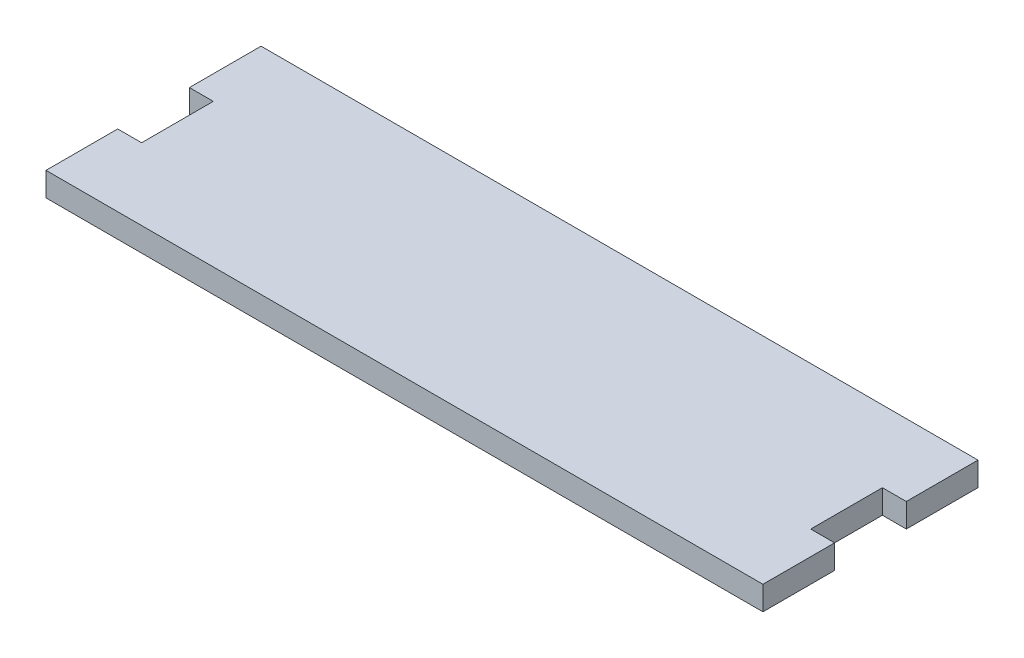
ISO-10303-21;
HEADER;
FILE_DESCRIPTION(('STEP AP214'),'2;1');
FILE_NAME('part.step','',(''),(''),'','','');
FILE_SCHEMA(('AUTOMOTIVE_DESIGN { 1 0 10303 214 1 1 1 1 }'));
ENDSEC;
DATA;
#1=APPLICATION_CONTEXT('core data for automotive mechanical design processes');
#2=APPLICATION_PROTOCOL_DEFINITION('international standard','automotive_design',2000,#1);
#3=PRODUCT_CONTEXT('',#1,'mechanical');
#4=PRODUCT('Part','Part','',(#3));
#5=PRODUCT_RELATED_PRODUCT_CATEGORY('part','',(#4));
#6=PRODUCT_DEFINITION_FORMATION('','',#4);
#7=PRODUCT_DEFINITION_CONTEXT('part definition',#1,'design');
#8=PRODUCT_DEFINITION('design','',#6,#7);
#9=PRODUCT_DEFINITION_SHAPE('','',#8);
#10=(LENGTH_UNIT() NAMED_UNIT(*) SI_UNIT(.MILLI.,.METRE.));
#11=(NAMED_UNIT(*) PLANE_ANGLE_UNIT() SI_UNIT($,.RADIAN.));
#12=(NAMED_UNIT(*) SI_UNIT($,.STERADIAN.) SOLID_ANGLE_UNIT());
#13=UNCERTAINTY_MEASURE_WITH_UNIT(LENGTH_MEASURE(1.E-05),#10,'distance_accuracy_value','');
#14=(GEOMETRIC_REPRESENTATION_CONTEXT(3) GLOBAL_UNCERTAINTY_ASSIGNED_CONTEXT((#13)) GLOBAL_UNIT_ASSIGNED_CONTEXT((#10,
#11,#12)) REPRESENTATION_CONTEXT('',''));
#15=CARTESIAN_POINT('',(0.,0.,0.));
#16=DIRECTION('',(0.,0.,1.));
#17=DIRECTION('',(1.,0.,0.));
#18=AXIS2_PLACEMENT_3D('',#15,#16,#17);
#19=CARTESIAN_POINT('',(70.,5.,0.));
#20=DIRECTION('',(1.,0.,0.));
#21=DIRECTION('',(0.,0.,-1.));
#22=AXIS2_PLACEMENT_3D('',#19,#20,#21);
#23=PLANE('',#22);
#24=DIRECTION('',(0.,0.,1.));
#25=VECTOR('',#24,1.);
#26=CARTESIAN_POINT('',(70.,0.,0.));
#27=LINE('',#26,#25);
#28=CARTESIAN_POINT('',(70.,0.,-7.5));
#29=VERTEX_POINT('',#28);
#30=CARTESIAN_POINT('',(70.,0.,7.5));
#31=VERTEX_POINT('',#30);
#32=EDGE_CURVE('E153',#29,#31,#27,.T.);
#33=ORIENTED_EDGE('',*,*,#32,.F.);
#34=DIRECTION('',(0.,-1.,0.));
#35=VECTOR('',#34,1.);
#36=CARTESIAN_POINT('',(70.,5.,-7.5));
#37=LINE('',#36,#35);
#38=CARTESIAN_POINT('',(70.,5.,-7.5));
#39=VERTEX_POINT('',#38);
#40=EDGE_CURVE('E11',#39,#29,#37,.T.);
#41=ORIENTED_EDGE('',*,*,#40,.F.);
#42=DIRECTION('',(0.,0.,1.));
#43=VECTOR('',#42,1.);
#44=CARTESIAN_POINT('',(70.,5.,0.));
#45=LINE('',#44,#43);
#46=CARTESIAN_POINT('',(70.,5.,7.5));
#47=VERTEX_POINT('',#46);
#48=EDGE_CURVE('E184',#39,#47,#45,.T.);
#49=ORIENTED_EDGE('',*,*,#48,.T.);
#50=DIRECTION('',(0.,-1.,0.));
#51=VECTOR('',#50,1.);
#52=CARTESIAN_POINT('',(70.,5.,7.5));
#53=LINE('',#52,#51);
#54=EDGE_CURVE('E52',#47,#31,#53,.T.);
#55=ORIENTED_EDGE('',*,*,#54,.T.);
#56=EDGE_LOOP('',(#33,#41,#49,#55));
#57=FACE_BOUND('',#56,.T.);
#58=ADVANCED_FACE('F36',(#57),#23,.T.);
#59=CARTESIAN_POINT('',(0.,5.,-7.5));
#60=DIRECTION('',(0.,0.,-1.));
#61=DIRECTION('',(-1.,0.,0.));
#62=AXIS2_PLACEMENT_3D('',#59,#60,#61);
#63=PLANE('',#62);
#64=DIRECTION('',(1.,0.,0.));
#65=VECTOR('',#64,1.);
#66=CARTESIAN_POINT('',(0.,0.,-7.5));
#67=LINE('',#66,#65);
#68=CARTESIAN_POINT('',(75.,0.,-7.5));
#69=VERTEX_POINT('',#68);
#70=EDGE_CURVE('E155',#29,#69,#67,.T.);
#71=ORIENTED_EDGE('',*,*,#70,.T.);
#72=DIRECTION('',(0.,-1.,0.));
#73=VECTOR('',#72,1.);
#74=CARTESIAN_POINT('',(75.,5.,-7.5));
#75=LINE('',#74,#73);
#76=CARTESIAN_POINT('',(75.,5.,-7.5));
#77=VERTEX_POINT('',#76);
#78=EDGE_CURVE('E44',#77,#69,#75,.T.);
#79=ORIENTED_EDGE('',*,*,#78,.F.);
#80=DIRECTION('',(1.,0.,0.));
#81=VECTOR('',#80,1.);
#82=CARTESIAN_POINT('',(0.,5.,-7.5));
#83=LINE('',#82,#81);
#84=EDGE_CURVE('E220',#39,#77,#83,.T.);
#85=ORIENTED_EDGE('',*,*,#84,.F.);
#86=ORIENTED_EDGE('',*,*,#40,.T.);
#87=EDGE_LOOP('',(#71,#79,#85,#86));
#88=FACE_BOUND('',#87,.T.);
#89=ADVANCED_FACE('F209',(#88),#63,.F.);
#90=CARTESIAN_POINT('',(75.,5.,0.));
#91=DIRECTION('',(1.,0.,0.));
#92=DIRECTION('',(0.,0.,-1.));
#93=AXIS2_PLACEMENT_3D('',#90,#91,#92);
#94=PLANE('',#93);
#95=DIRECTION('',(0.,0.,1.));
#96=VECTOR('',#95,1.);
#97=CARTESIAN_POINT('',(75.,0.,0.));
#98=LINE('',#97,#96);
#99=CARTESIAN_POINT('',(75.,0.,-22.5));
#100=VERTEX_POINT('',#99);
#101=EDGE_CURVE('E158',#100,#69,#98,.T.);
#102=ORIENTED_EDGE('',*,*,#101,.F.);
#103=DIRECTION('',(0.,-1.,0.));
#104=VECTOR('',#103,1.);
#105=CARTESIAN_POINT('',(75.,5.,-22.5));
#106=LINE('',#105,#104);
#107=CARTESIAN_POINT('',(75.,5.,-22.5));
#108=VERTEX_POINT('',#107);
#109=EDGE_CURVE('E199',#108,#100,#106,.T.);
#110=ORIENTED_EDGE('',*,*,#109,.F.);
#111=DIRECTION('',(0.,0.,1.));
#112=VECTOR('',#111,1.);
#113=CARTESIAN_POINT('',(75.,5.,0.));
#114=LINE('',#113,#112);
#115=EDGE_CURVE('E206',#108,#77,#114,.T.);
#116=ORIENTED_EDGE('',*,*,#115,.T.);
#117=ORIENTED_EDGE('',*,*,#78,.T.);
#118=EDGE_LOOP('',(#102,#110,#116,#117));
#119=FACE_BOUND('',#118,.T.);
#120=ADVANCED_FACE('F204',(#119),#94,.T.);
#121=CARTESIAN_POINT('',(0.,5.,-22.5));
#122=DIRECTION('',(0.,0.,-1.));
#123=DIRECTION('',(-1.,0.,0.));
#124=AXIS2_PLACEMENT_3D('',#121,#122,#123);
#125=PLANE('',#124);
#126=DIRECTION('',(1.,0.,0.));
#127=VECTOR('',#126,1.);
#128=CARTESIAN_POINT('',(0.,0.,-22.5));
#129=LINE('',#128,#127);
#130=CARTESIAN_POINT('',(-75.,0.,-22.5));
#131=VERTEX_POINT('',#130);
#132=EDGE_CURVE('E161',#131,#100,#129,.T.);
#133=ORIENTED_EDGE('',*,*,#132,.F.);
#134=DIRECTION('',(0.,-1.,0.));
#135=VECTOR('',#134,1.);
#136=CARTESIAN_POINT('',(-75.,5.,-22.5));
#137=LINE('',#136,#135);
#138=CARTESIAN_POINT('',(-75.,5.,-22.5));
#139=VERTEX_POINT('',#138);
#140=EDGE_CURVE('E197',#139,#131,#137,.T.);
#141=ORIENTED_EDGE('',*,*,#140,.F.);
#142=DIRECTION('',(1.,0.,0.));
#143=VECTOR('',#142,1.);
#144=CARTESIAN_POINT('',(0.,5.,-22.5));
#145=LINE('',#144,#143);
#146=EDGE_CURVE('E219',#139,#108,#145,.T.);
#147=ORIENTED_EDGE('',*,*,#146,.T.);
#148=ORIENTED_EDGE('',*,*,#109,.T.);
#149=EDGE_LOOP('',(#133,#141,#147,#148));
#150=FACE_BOUND('',#149,.T.);
#151=ADVANCED_FACE('F215',(#150),#125,.T.);
#152=CARTESIAN_POINT('',(-75.,5.,0.));
#153=DIRECTION('',(1.,0.,0.));
#154=DIRECTION('',(0.,0.,-1.));
#155=AXIS2_PLACEMENT_3D('',#152,#153,#154);
#156=PLANE('',#155);
#157=DIRECTION('',(0.,0.,1.));
#158=VECTOR('',#157,1.);
#159=CARTESIAN_POINT('',(-75.,0.,0.));
#160=LINE('',#159,#158);
#161=CARTESIAN_POINT('',(-75.,0.,-7.5));
#162=VERTEX_POINT('',#161);
#163=EDGE_CURVE('E164',#131,#162,#160,.T.);
#164=ORIENTED_EDGE('',*,*,#163,.T.);
#165=DIRECTION('',(0.,-1.,0.));
#166=VECTOR('',#165,1.);
#167=CARTESIAN_POINT('',(-75.,5.,-7.5));
#168=LINE('',#167,#166);
#169=CARTESIAN_POINT('',(-75.,5.,-7.5));
#170=VERTEX_POINT('',#169);
#171=EDGE_CURVE('E195',#170,#162,#168,.T.);
#172=ORIENTED_EDGE('',*,*,#171,.F.);
#173=DIRECTION('',(0.,0.,1.));
#174=VECTOR('',#173,1.);
#175=CARTESIAN_POINT('',(-75.,5.,0.));
#176=LINE('',#175,#174);
#177=EDGE_CURVE('E222',#139,#170,#176,.T.);
#178=ORIENTED_EDGE('',*,*,#177,.F.);
#179=ORIENTED_EDGE('',*,*,#140,.T.);
#180=EDGE_LOOP('',(#164,#172,#178,#179));
#181=FACE_BOUND('',#180,.T.);
#182=ADVANCED_FACE('F260',(#181),#156,.F.);
#183=CARTESIAN_POINT('',(0.,5.,-7.50000000000001));
#184=DIRECTION('',(0.,0.,1.));
#185=DIRECTION('',(1.,0.,0.));
#186=AXIS2_PLACEMENT_3D('',#183,#184,#185);
#187=PLANE('',#186);
#188=DIRECTION('',(-1.,0.,0.));
#189=VECTOR('',#188,1.);
#190=CARTESIAN_POINT('',(0.,0.,-7.50000000000001));
#191=LINE('',#190,#189);
#192=CARTESIAN_POINT('',(-70.,0.,-7.5));
#193=VERTEX_POINT('',#192);
#194=EDGE_CURVE('E167',#193,#162,#191,.T.);
#195=ORIENTED_EDGE('',*,*,#194,.F.);
#196=DIRECTION('',(0.,-1.,0.));
#197=VECTOR('',#196,1.);
#198=CARTESIAN_POINT('',(-70.,5.,-7.5));
#199=LINE('',#198,#197);
#200=CARTESIAN_POINT('',(-70.,5.,-7.5));
#201=VERTEX_POINT('',#200);
#202=EDGE_CURVE('E193',#201,#193,#199,.T.);
#203=ORIENTED_EDGE('',*,*,#202,.F.);
#204=DIRECTION('',(-1.,0.,0.));
#205=VECTOR('',#204,1.);
#206=CARTESIAN_POINT('',(0.,5.,-7.50000000000001));
#207=LINE('',#206,#205);
#208=EDGE_CURVE('E228',#201,#170,#207,.T.);
#209=ORIENTED_EDGE('',*,*,#208,.T.);
#210=ORIENTED_EDGE('',*,*,#171,.T.);
#211=EDGE_LOOP('',(#195,#203,#209,#210));
#212=FACE_BOUND('',#211,.T.);
#213=ADVANCED_FACE('F263',(#212),#187,.T.);
#214=CARTESIAN_POINT('',(-70.,5.,0.));
#215=DIRECTION('',(1.,0.,0.));
#216=DIRECTION('',(0.,0.,-1.));
#217=AXIS2_PLACEMENT_3D('',#214,#215,#216);
#218=PLANE('',#217);
#219=DIRECTION('',(0.,0.,1.));
#220=VECTOR('',#219,1.);
#221=CARTESIAN_POINT('',(-70.,0.,0.));
#222=LINE('',#221,#220);
#223=CARTESIAN_POINT('',(-70.,0.,7.5));
#224=VERTEX_POINT('',#223);
#225=EDGE_CURVE('E170',#193,#224,#222,.T.);
#226=ORIENTED_EDGE('',*,*,#225,.T.);
#227=DIRECTION('',(0.,-1.,0.));
#228=VECTOR('',#227,1.);
#229=CARTESIAN_POINT('',(-70.,5.,7.5));
#230=LINE('',#229,#228);
#231=CARTESIAN_POINT('',(-70.,5.,7.5));
#232=VERTEX_POINT('',#231);
#233=EDGE_CURVE('E190',#232,#224,#230,.T.);
#234=ORIENTED_EDGE('',*,*,#233,.F.);
#235=DIRECTION('',(0.,0.,1.));
#236=VECTOR('',#235,1.);
#237=CARTESIAN_POINT('',(-70.,5.,0.));
#238=LINE('',#237,#236);
#239=EDGE_CURVE('E231',#201,#232,#238,.T.);
#240=ORIENTED_EDGE('',*,*,#239,.F.);
#241=ORIENTED_EDGE('',*,*,#202,.T.);
#242=EDGE_LOOP('',(#226,#234,#240,#241));
#243=FACE_BOUND('',#242,.T.);
#244=ADVANCED_FACE('F267',(#243),#218,.F.);
#245=CARTESIAN_POINT('',(0.,5.,7.5));
#246=DIRECTION('',(0.,0.,1.));
#247=DIRECTION('',(1.,0.,0.));
#248=AXIS2_PLACEMENT_3D('',#245,#246,#247);
#249=PLANE('',#248);
#250=DIRECTION('',(-1.,0.,0.));
#251=VECTOR('',#250,1.);
#252=CARTESIAN_POINT('',(0.,0.,7.5));
#253=LINE('',#252,#251);
#254=CARTESIAN_POINT('',(-75.,0.,7.5));
#255=VERTEX_POINT('',#254);
#256=EDGE_CURVE('E172',#224,#255,#253,.T.);
#257=ORIENTED_EDGE('',*,*,#256,.T.);
#258=DIRECTION('',(0.,-1.,0.));
#259=VECTOR('',#258,1.);
#260=CARTESIAN_POINT('',(-75.,5.,7.5));
#261=LINE('',#260,#259);
#262=CARTESIAN_POINT('',(-75.,5.,7.5));
#263=VERTEX_POINT('',#262);
#264=EDGE_CURVE('E188',#263,#255,#261,.T.);
#265=ORIENTED_EDGE('',*,*,#264,.F.);
#266=DIRECTION('',(-1.,0.,0.));
#267=VECTOR('',#266,1.);
#268=CARTESIAN_POINT('',(0.,5.,7.5));
#269=LINE('',#268,#267);
#270=EDGE_CURVE('E233',#232,#263,#269,.T.);
#271=ORIENTED_EDGE('',*,*,#270,.F.);
#272=ORIENTED_EDGE('',*,*,#233,.T.);
#273=EDGE_LOOP('',(#257,#265,#271,#272));
#274=FACE_BOUND('',#273,.T.);
#275=ADVANCED_FACE('F271',(#274),#249,.F.);
#276=CARTESIAN_POINT('',(-75.,5.,0.));
#277=DIRECTION('',(-1.,0.,0.));
#278=DIRECTION('',(0.,0.,1.));
#279=AXIS2_PLACEMENT_3D('',#276,#277,#278);
#280=PLANE('',#279);
#281=DIRECTION('',(0.,0.,-1.));
#282=VECTOR('',#281,1.);
#283=CARTESIAN_POINT('',(-75.,0.,0.));
#284=LINE('',#283,#282);
#285=CARTESIAN_POINT('',(-75.,0.,22.5));
#286=VERTEX_POINT('',#285);
#287=EDGE_CURVE('E175',#286,#255,#284,.T.);
#288=ORIENTED_EDGE('',*,*,#287,.F.);
#289=DIRECTION('',(0.,-1.,0.));
#290=VECTOR('',#289,1.);
#291=CARTESIAN_POINT('',(-75.,5.,22.5));
#292=LINE('',#291,#290);
#293=CARTESIAN_POINT('',(-75.,5.,22.5));
#294=VERTEX_POINT('',#293);
#295=EDGE_CURVE('E145',#294,#286,#292,.T.);
#296=ORIENTED_EDGE('',*,*,#295,.F.);
#297=DIRECTION('',(0.,0.,-1.));
#298=VECTOR('',#297,1.);
#299=CARTESIAN_POINT('',(-75.,5.,0.));
#300=LINE('',#299,#298);
#301=EDGE_CURVE('E135',#294,#263,#300,.T.);
#302=ORIENTED_EDGE('',*,*,#301,.T.);
#303=ORIENTED_EDGE('',*,*,#264,.T.);
#304=EDGE_LOOP('',(#288,#296,#302,#303));
#305=FACE_BOUND('',#304,.T.);
#306=ADVANCED_FACE('F236',(#305),#280,.T.);
#307=CARTESIAN_POINT('',(0.,5.,22.5));
#308=DIRECTION('',(0.,0.,-1.));
#309=DIRECTION('',(-1.,0.,0.));
#310=AXIS2_PLACEMENT_3D('',#307,#308,#309);
#311=PLANE('',#310);
#312=DIRECTION('',(1.,0.,0.));
#313=VECTOR('',#312,1.);
#314=CARTESIAN_POINT('',(0.,0.,22.5));
#315=LINE('',#314,#313);
#316=CARTESIAN_POINT('',(75.,0.,22.5));
#317=VERTEX_POINT('',#316);
#318=EDGE_CURVE('E142',#286,#317,#315,.T.);
#319=ORIENTED_EDGE('',*,*,#318,.T.);
#320=DIRECTION('',(0.,-1.,0.));
#321=VECTOR('',#320,1.);
#322=CARTESIAN_POINT('',(75.,5.,22.5));
#323=LINE('',#322,#321);
#324=CARTESIAN_POINT('',(75.,5.,22.5));
#325=VERTEX_POINT('',#324);
#326=EDGE_CURVE('E139',#325,#317,#323,.T.);
#327=ORIENTED_EDGE('',*,*,#326,.F.);
#328=DIRECTION('',(1.,0.,0.));
#329=VECTOR('',#328,1.);
#330=CARTESIAN_POINT('',(0.,5.,22.5));
#331=LINE('',#330,#329);
#332=EDGE_CURVE('E127',#294,#325,#331,.T.);
#333=ORIENTED_EDGE('',*,*,#332,.F.);
#334=ORIENTED_EDGE('',*,*,#295,.T.);
#335=EDGE_LOOP('',(#319,#327,#333,#334));
#336=FACE_BOUND('',#335,.T.);
#337=ADVANCED_FACE('F140',(#336),#311,.F.);
#338=CARTESIAN_POINT('',(75.,5.,0.));
#339=DIRECTION('',(-1.,0.,0.));
#340=DIRECTION('',(0.,0.,1.));
#341=AXIS2_PLACEMENT_3D('',#338,#339,#340);
#342=PLANE('',#341);
#343=DIRECTION('',(0.,0.,-1.));
#344=VECTOR('',#343,1.);
#345=CARTESIAN_POINT('',(75.,0.,0.));
#346=LINE('',#345,#344);
#347=CARTESIAN_POINT('',(75.,0.,7.5));
#348=VERTEX_POINT('',#347);
#349=EDGE_CURVE('E179',#317,#348,#346,.T.);
#350=ORIENTED_EDGE('',*,*,#349,.T.);
#351=DIRECTION('',(0.,-1.,0.));
#352=VECTOR('',#351,1.);
#353=CARTESIAN_POINT('',(75.,5.,7.5));
#354=LINE('',#353,#352);
#355=CARTESIAN_POINT('',(75.,5.,7.5));
#356=VERTEX_POINT('',#355);
#357=EDGE_CURVE('E90',#356,#348,#354,.T.);
#358=ORIENTED_EDGE('',*,*,#357,.F.);
#359=DIRECTION('',(0.,0.,-1.));
#360=VECTOR('',#359,1.);
#361=CARTESIAN_POINT('',(75.,5.,0.));
#362=LINE('',#361,#360);
#363=EDGE_CURVE('E133',#325,#356,#362,.T.);
#364=ORIENTED_EDGE('',*,*,#363,.F.);
#365=ORIENTED_EDGE('',*,*,#326,.T.);
#366=EDGE_LOOP('',(#350,#358,#364,#365));
#367=FACE_BOUND('',#366,.T.);
#368=ADVANCED_FACE('F147',(#367),#342,.F.);
#369=CARTESIAN_POINT('',(0.,5.,7.5));
#370=DIRECTION('',(0.,0.,-1.));
#371=DIRECTION('',(-1.,0.,0.));
#372=AXIS2_PLACEMENT_3D('',#369,#370,#371);
#373=PLANE('',#372);
#374=DIRECTION('',(1.,0.,0.));
#375=VECTOR('',#374,1.);
#376=CARTESIAN_POINT('',(0.,0.,7.5));
#377=LINE('',#376,#375);
#378=EDGE_CURVE('E181',#31,#348,#377,.T.);
#379=ORIENTED_EDGE('',*,*,#378,.F.);
#380=ORIENTED_EDGE('',*,*,#54,.F.);
#381=DIRECTION('',(1.,0.,0.));
#382=VECTOR('',#381,1.);
#383=CARTESIAN_POINT('',(0.,5.,7.5));
#384=LINE('',#383,#382);
#385=EDGE_CURVE('E148',#47,#356,#384,.T.);
#386=ORIENTED_EDGE('',*,*,#385,.T.);
#387=ORIENTED_EDGE('',*,*,#357,.T.);
#388=EDGE_LOOP('',(#379,#380,#386,#387));
#389=FACE_BOUND('',#388,.T.);
#390=ADVANCED_FACE('F239',(#389),#373,.T.);
#391=CARTESIAN_POINT('',(0.,5.,0.));
#392=DIRECTION('',(0.,1.,0.));
#393=DIRECTION('',(0.,0.,1.));
#394=AXIS2_PLACEMENT_3D('',#391,#392,#393);
#395=PLANE('',#394);
#396=ORIENTED_EDGE('',*,*,#48,.F.);
#397=ORIENTED_EDGE('',*,*,#84,.T.);
#398=ORIENTED_EDGE('',*,*,#115,.F.);
#399=ORIENTED_EDGE('',*,*,#146,.F.);
#400=ORIENTED_EDGE('',*,*,#177,.T.);
#401=ORIENTED_EDGE('',*,*,#208,.F.);
#402=ORIENTED_EDGE('',*,*,#239,.T.);
#403=ORIENTED_EDGE('',*,*,#270,.T.);
#404=ORIENTED_EDGE('',*,*,#301,.F.);
#405=ORIENTED_EDGE('',*,*,#332,.T.);
#406=ORIENTED_EDGE('',*,*,#363,.T.);
#407=ORIENTED_EDGE('',*,*,#385,.F.);
#408=EDGE_LOOP('',(#396,#397,#398,#399,#400,#401,#402,#403,#404,#405,#406,#407));
#409=FACE_BOUND('',#408,.T.);
#410=ADVANCED_FACE('F130',(#409),#395,.T.);
#411=CARTESIAN_POINT('',(0.,0.,0.));
#412=DIRECTION('',(0.,1.,0.));
#413=DIRECTION('',(0.,0.,1.));
#414=AXIS2_PLACEMENT_3D('',#411,#412,#413);
#415=PLANE('',#414);
#416=ORIENTED_EDGE('',*,*,#32,.T.);
#417=ORIENTED_EDGE('',*,*,#378,.T.);
#418=ORIENTED_EDGE('',*,*,#349,.F.);
#419=ORIENTED_EDGE('',*,*,#318,.F.);
#420=ORIENTED_EDGE('',*,*,#287,.T.);
#421=ORIENTED_EDGE('',*,*,#256,.F.);
#422=ORIENTED_EDGE('',*,*,#225,.F.);
#423=ORIENTED_EDGE('',*,*,#194,.T.);
#424=ORIENTED_EDGE('',*,*,#163,.F.);
#425=ORIENTED_EDGE('',*,*,#132,.T.);
#426=ORIENTED_EDGE('',*,*,#101,.T.);
#427=ORIENTED_EDGE('',*,*,#70,.F.);
#428=EDGE_LOOP('',(#416,#417,#418,#419,#420,#421,#422,#423,#424,#425,#426,#427));
#429=FACE_BOUND('',#428,.T.);
#430=ADVANCED_FACE('F211',(#429),#415,.F.);
#431=CLOSED_SHELL('',(#58,#89,#120,#151,#182,#213,#244,#275,#306,#337,#368,#390,#410,#430));
#432=MANIFOLD_SOLID_BREP('B2',#431);
#433=ADVANCED_BREP_SHAPE_REPRESENTATION('',(#18,#432),#14);
#434=SHAPE_DEFINITION_REPRESENTATION(#9,#433);
ENDSEC;
END-ISO-10303-21;
